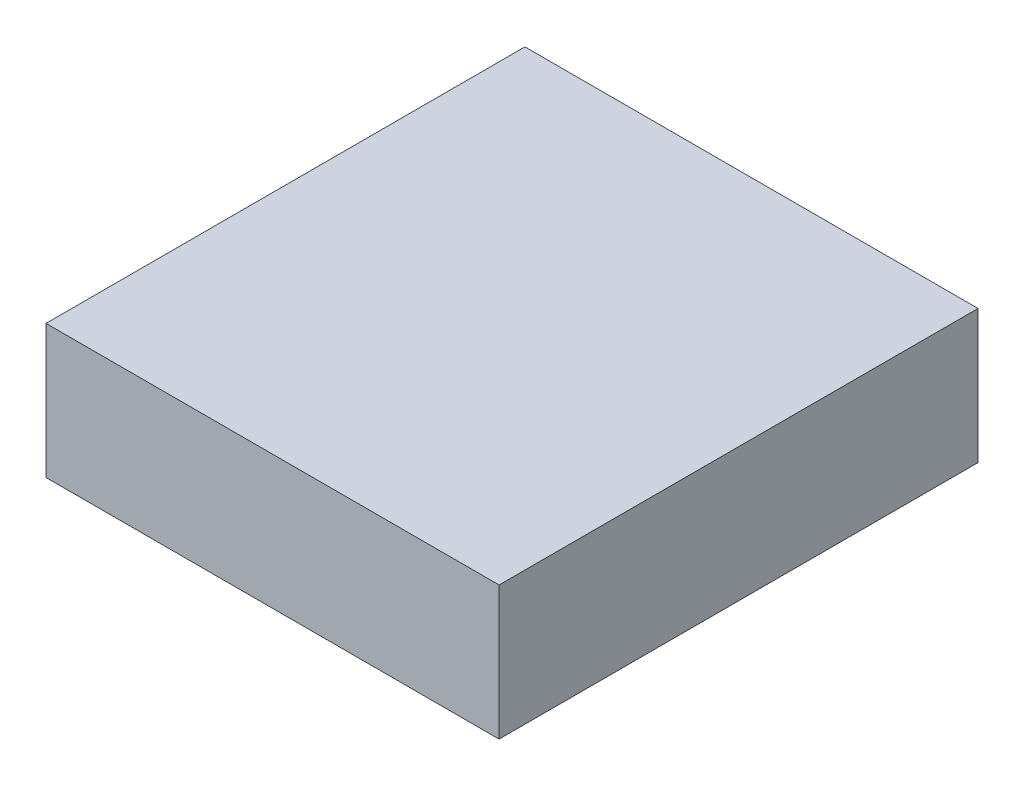
ISO-10303-21;
HEADER;
FILE_DESCRIPTION(('STEP AP214'),'2;1');
FILE_NAME('part.step','',(''),(''),'','','');
FILE_SCHEMA(('AUTOMOTIVE_DESIGN { 1 0 10303 214 1 1 1 1 }'));
ENDSEC;
DATA;
#1=APPLICATION_CONTEXT('core data for automotive mechanical design processes');
#2=APPLICATION_PROTOCOL_DEFINITION('international standard','automotive_design',2000,#1);
#3=PRODUCT_CONTEXT('',#1,'mechanical');
#4=PRODUCT('Part','Part','',(#3));
#5=PRODUCT_RELATED_PRODUCT_CATEGORY('part','',(#4));
#6=PRODUCT_DEFINITION_FORMATION('','',#4);
#7=PRODUCT_DEFINITION_CONTEXT('part definition',#1,'design');
#8=PRODUCT_DEFINITION('design','',#6,#7);
#9=PRODUCT_DEFINITION_SHAPE('','',#8);
#10=(LENGTH_UNIT() NAMED_UNIT(*) SI_UNIT(.MILLI.,.METRE.));
#11=(NAMED_UNIT(*) PLANE_ANGLE_UNIT() SI_UNIT($,.RADIAN.));
#12=(NAMED_UNIT(*) SI_UNIT($,.STERADIAN.) SOLID_ANGLE_UNIT());
#13=UNCERTAINTY_MEASURE_WITH_UNIT(LENGTH_MEASURE(1.E-05),#10,'distance_accuracy_value','');
#14=(GEOMETRIC_REPRESENTATION_CONTEXT(3) GLOBAL_UNCERTAINTY_ASSIGNED_CONTEXT((#13)) GLOBAL_UNIT_ASSIGNED_CONTEXT((#10,
#11,#12)) REPRESENTATION_CONTEXT('',''));
#15=CARTESIAN_POINT('',(0.,0.,0.));
#16=DIRECTION('',(0.,0.,1.));
#17=DIRECTION('',(1.,0.,0.));
#18=AXIS2_PLACEMENT_3D('',#15,#16,#17);
#19=CARTESIAN_POINT('',(-64.,18.86,-67.65));
#20=DIRECTION('',(1.,0.,0.));
#21=DIRECTION('',(0.,0.,-1.));
#22=AXIS2_PLACEMENT_3D('',#19,#20,#21);
#23=PLANE('',#22);
#24=DIRECTION('',(0.,0.,1.));
#25=VECTOR('',#24,1.);
#26=CARTESIAN_POINT('',(-64.,0.,-67.65));
#27=LINE('',#26,#25);
#28=CARTESIAN_POINT('',(-64.,0.,-67.65));
#29=VERTEX_POINT('',#28);
#30=CARTESIAN_POINT('',(-64.,0.,0.));
#31=VERTEX_POINT('',#30);
#32=EDGE_CURVE('E96',#29,#31,#27,.T.);
#33=ORIENTED_EDGE('',*,*,#32,.T.);
#34=DIRECTION('',(0.,-1.,0.));
#35=VECTOR('',#34,1.);
#36=CARTESIAN_POINT('',(-64.,18.86,0.));
#37=LINE('',#36,#35);
#38=CARTESIAN_POINT('',(-64.,18.86,0.));
#39=VERTEX_POINT('',#38);
#40=EDGE_CURVE('E11',#39,#31,#37,.T.);
#41=ORIENTED_EDGE('',*,*,#40,.F.);
#42=DIRECTION('',(0.,0.,1.));
#43=VECTOR('',#42,1.);
#44=CARTESIAN_POINT('',(-64.,18.86,-67.65));
#45=LINE('',#44,#43);
#46=CARTESIAN_POINT('',(-64.,18.86,-67.65));
#47=VERTEX_POINT('',#46);
#48=EDGE_CURVE('E84',#47,#39,#45,.T.);
#49=ORIENTED_EDGE('',*,*,#48,.F.);
#50=DIRECTION('',(0.,-1.,0.));
#51=VECTOR('',#50,1.);
#52=CARTESIAN_POINT('',(-64.,18.86,-67.65));
#53=LINE('',#52,#51);
#54=EDGE_CURVE('E92',#47,#29,#53,.T.);
#55=ORIENTED_EDGE('',*,*,#54,.T.);
#56=EDGE_LOOP('',(#33,#41,#49,#55));
#57=FACE_BOUND('',#56,.T.);
#58=ADVANCED_FACE('F33',(#57),#23,.F.);
#59=CARTESIAN_POINT('',(-64.,18.86,0.));
#60=DIRECTION('',(0.,0.,-1.));
#61=DIRECTION('',(-1.,0.,0.));
#62=AXIS2_PLACEMENT_3D('',#59,#60,#61);
#63=PLANE('',#62);
#64=DIRECTION('',(1.,0.,0.));
#65=VECTOR('',#64,1.);
#66=CARTESIAN_POINT('',(-64.,0.,0.));
#67=LINE('',#66,#65);
#68=CARTESIAN_POINT('',(0.,0.,0.));
#69=VERTEX_POINT('',#68);
#70=EDGE_CURVE('E88',#31,#69,#67,.T.);
#71=ORIENTED_EDGE('',*,*,#70,.T.);
#72=DIRECTION('',(0.,-1.,0.));
#73=VECTOR('',#72,1.);
#74=CARTESIAN_POINT('',(0.,18.86,0.));
#75=LINE('',#74,#73);
#76=CARTESIAN_POINT('',(0.,18.86,0.));
#77=VERTEX_POINT('',#76);
#78=EDGE_CURVE('E41',#77,#69,#75,.T.);
#79=ORIENTED_EDGE('',*,*,#78,.F.);
#80=DIRECTION('',(1.,0.,0.));
#81=VECTOR('',#80,1.);
#82=CARTESIAN_POINT('',(-64.,18.86,0.));
#83=LINE('',#82,#81);
#84=EDGE_CURVE('E79',#39,#77,#83,.T.);
#85=ORIENTED_EDGE('',*,*,#84,.F.);
#86=ORIENTED_EDGE('',*,*,#40,.T.);
#87=EDGE_LOOP('',(#71,#79,#85,#86));
#88=FACE_BOUND('',#87,.T.);
#89=ADVANCED_FACE('F87',(#88),#63,.F.);
#90=CARTESIAN_POINT('',(0.,18.86,-67.65));
#91=DIRECTION('',(-1.,0.,0.));
#92=DIRECTION('',(0.,0.,1.));
#93=AXIS2_PLACEMENT_3D('',#90,#91,#92);
#94=PLANE('',#93);
#95=DIRECTION('',(0.,0.,-1.));
#96=VECTOR('',#95,1.);
#97=CARTESIAN_POINT('',(0.,0.,-67.65));
#98=LINE('',#97,#96);
#99=CARTESIAN_POINT('',(0.,0.,-67.65));
#100=VERTEX_POINT('',#99);
#101=EDGE_CURVE('E66',#69,#100,#98,.T.);
#102=ORIENTED_EDGE('',*,*,#101,.T.);
#103=DIRECTION('',(0.,-1.,0.));
#104=VECTOR('',#103,1.);
#105=CARTESIAN_POINT('',(0.,18.86,-67.65));
#106=LINE('',#105,#104);
#107=CARTESIAN_POINT('',(0.,18.86,-67.65));
#108=VERTEX_POINT('',#107);
#109=EDGE_CURVE('E89',#108,#100,#106,.T.);
#110=ORIENTED_EDGE('',*,*,#109,.F.);
#111=DIRECTION('',(0.,0.,-1.));
#112=VECTOR('',#111,1.);
#113=CARTESIAN_POINT('',(0.,18.86,-67.65));
#114=LINE('',#113,#112);
#115=EDGE_CURVE('E82',#77,#108,#114,.T.);
#116=ORIENTED_EDGE('',*,*,#115,.F.);
#117=ORIENTED_EDGE('',*,*,#78,.T.);
#118=EDGE_LOOP('',(#102,#110,#116,#117));
#119=FACE_BOUND('',#118,.T.);
#120=ADVANCED_FACE('F90',(#119),#94,.F.);
#121=CARTESIAN_POINT('',(-64.,18.86,-67.65));
#122=DIRECTION('',(0.,0.,1.));
#123=DIRECTION('',(1.,0.,0.));
#124=AXIS2_PLACEMENT_3D('',#121,#122,#123);
#125=PLANE('',#124);
#126=DIRECTION('',(-1.,0.,0.));
#127=VECTOR('',#126,1.);
#128=CARTESIAN_POINT('',(-64.,0.,-67.65));
#129=LINE('',#128,#127);
#130=EDGE_CURVE('E72',#100,#29,#129,.T.);
#131=ORIENTED_EDGE('',*,*,#130,.T.);
#132=ORIENTED_EDGE('',*,*,#54,.F.);
#133=DIRECTION('',(-1.,0.,0.));
#134=VECTOR('',#133,1.);
#135=CARTESIAN_POINT('',(-64.,18.86,-67.65));
#136=LINE('',#135,#134);
#137=EDGE_CURVE('E49',#108,#47,#136,.T.);
#138=ORIENTED_EDGE('',*,*,#137,.F.);
#139=ORIENTED_EDGE('',*,*,#109,.T.);
#140=EDGE_LOOP('',(#131,#132,#138,#139));
#141=FACE_BOUND('',#140,.T.);
#142=ADVANCED_FACE('F103',(#141),#125,.F.);
#143=CARTESIAN_POINT('',(0.,18.86,0.));
#144=DIRECTION('',(0.,1.,0.));
#145=DIRECTION('',(0.,0.,1.));
#146=AXIS2_PLACEMENT_3D('',#143,#144,#145);
#147=PLANE('',#146);
#148=ORIENTED_EDGE('',*,*,#48,.T.);
#149=ORIENTED_EDGE('',*,*,#84,.T.);
#150=ORIENTED_EDGE('',*,*,#115,.T.);
#151=ORIENTED_EDGE('',*,*,#137,.T.);
#152=EDGE_LOOP('',(#148,#149,#150,#151));
#153=FACE_BOUND('',#152,.T.);
#154=ADVANCED_FACE('F80',(#153),#147,.T.);
#155=CARTESIAN_POINT('',(0.,0.,0.));
#156=DIRECTION('',(0.,1.,0.));
#157=DIRECTION('',(0.,0.,1.));
#158=AXIS2_PLACEMENT_3D('',#155,#156,#157);
#159=PLANE('',#158);
#160=ORIENTED_EDGE('',*,*,#32,.F.);
#161=ORIENTED_EDGE('',*,*,#130,.F.);
#162=ORIENTED_EDGE('',*,*,#101,.F.);
#163=ORIENTED_EDGE('',*,*,#70,.F.);
#164=EDGE_LOOP('',(#160,#161,#162,#163));
#165=FACE_BOUND('',#164,.T.);
#166=ADVANCED_FACE('F106',(#165),#159,.F.);
#167=CLOSED_SHELL('',(#58,#89,#120,#142,#154,#166));
#168=MANIFOLD_SOLID_BREP('B2',#167);
#169=ADVANCED_BREP_SHAPE_REPRESENTATION('',(#18,#168),#14);
#170=SHAPE_DEFINITION_REPRESENTATION(#9,#169);
ENDSEC;
END-ISO-10303-21;
